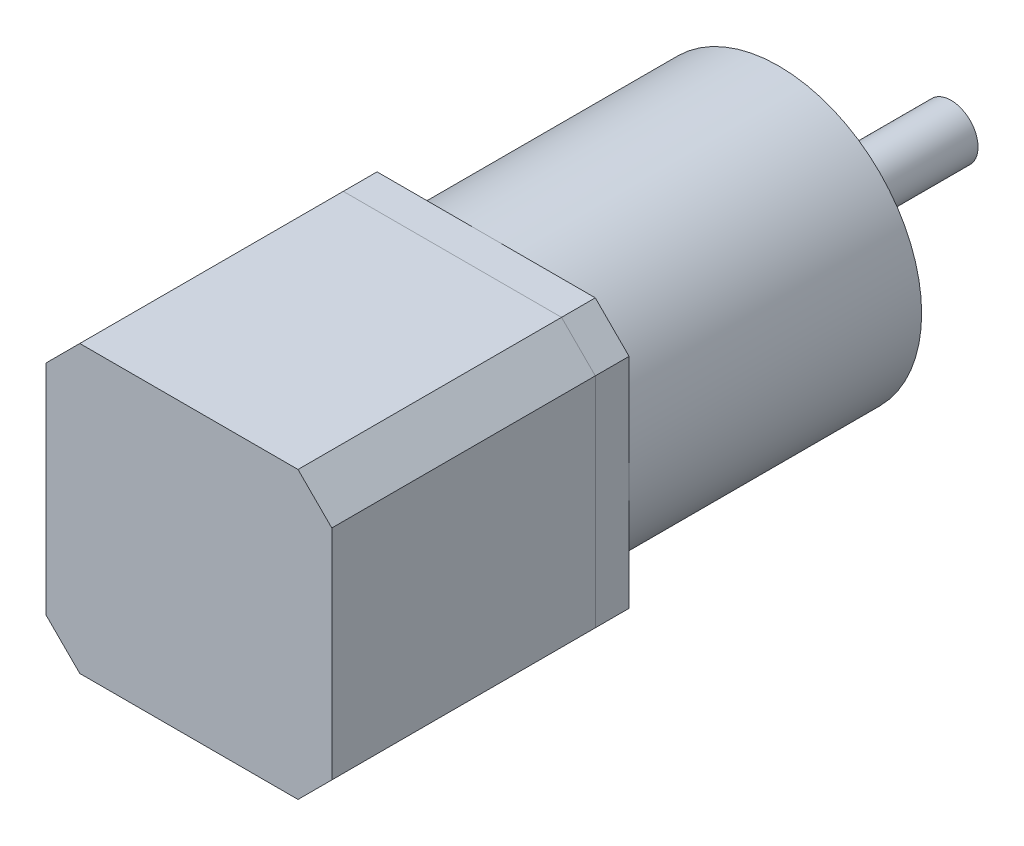
ISO-10303-21;
HEADER;
FILE_DESCRIPTION(('STEP AP214'),'2;1');
FILE_NAME('part.step','',(''),(''),'','','');
FILE_SCHEMA(('AUTOMOTIVE_DESIGN { 1 0 10303 214 1 1 1 1 }'));
ENDSEC;
DATA;
#1=APPLICATION_CONTEXT('core data for automotive mechanical design processes');
#2=APPLICATION_PROTOCOL_DEFINITION('international standard','automotive_design',2000,#1);
#3=PRODUCT_CONTEXT('',#1,'mechanical');
#4=PRODUCT('Part','Part','',(#3));
#5=PRODUCT_RELATED_PRODUCT_CATEGORY('part','',(#4));
#6=PRODUCT_DEFINITION_FORMATION('','',#4);
#7=PRODUCT_DEFINITION_CONTEXT('part definition',#1,'design');
#8=PRODUCT_DEFINITION('design','',#6,#7);
#9=PRODUCT_DEFINITION_SHAPE('','',#8);
#10=(LENGTH_UNIT() NAMED_UNIT(*) SI_UNIT(.MILLI.,.METRE.));
#11=(NAMED_UNIT(*) PLANE_ANGLE_UNIT() SI_UNIT($,.RADIAN.));
#12=(NAMED_UNIT(*) SI_UNIT($,.STERADIAN.) SOLID_ANGLE_UNIT());
#13=UNCERTAINTY_MEASURE_WITH_UNIT(LENGTH_MEASURE(1.E-05),#10,'distance_accuracy_value','');
#14=(GEOMETRIC_REPRESENTATION_CONTEXT(3) GLOBAL_UNCERTAINTY_ASSIGNED_CONTEXT((#13)) GLOBAL_UNIT_ASSIGNED_CONTEXT((#10,
#11,#12)) REPRESENTATION_CONTEXT('',''));
#15=CARTESIAN_POINT('',(0.,0.,0.));
#16=DIRECTION('',(0.,0.,1.));
#17=DIRECTION('',(1.,0.,0.));
#18=AXIS2_PLACEMENT_3D('',#15,#16,#17);
#19=CARTESIAN_POINT('',(0.,0.,-50.8));
#20=DIRECTION('',(0.,0.,1.));
#21=DIRECTION('',(1.,0.,0.));
#22=AXIS2_PLACEMENT_3D('',#19,#20,#21);
#23=CYLINDRICAL_SURFACE('',#22,6.21097509165244);
#24=CARTESIAN_POINT('',(0.,0.,-50.8));
#25=DIRECTION('',(0.,0.,-1.));
#26=DIRECTION('',(-1.,0.,0.));
#27=AXIS2_PLACEMENT_3D('',#24,#25,#26);
#28=CIRCLE('',#27,6.21097509165244);
#29=CARTESIAN_POINT('',(-6.21097509165244,0.,-50.8));
#30=VERTEX_POINT('',#29);
#31=EDGE_CURVE('E11',#30,#30,#28,.T.);
#32=ORIENTED_EDGE('',*,*,#31,.F.);
#33=EDGE_LOOP('',(#32));
#34=FACE_BOUND('',#33,.T.);
#35=CARTESIAN_POINT('',(0.,0.,-50.3));
#36=DIRECTION('',(0.,0.,-1.));
#37=DIRECTION('',(-1.,0.,0.));
#38=AXIS2_PLACEMENT_3D('',#35,#36,#37);
#39=CIRCLE('',#38,6.21097509165244);
#40=CARTESIAN_POINT('',(-6.21097509165244,0.,-50.3));
#41=VERTEX_POINT('',#40);
#42=EDGE_CURVE('E50',#41,#41,#39,.T.);
#43=ORIENTED_EDGE('',*,*,#42,.T.);
#44=EDGE_LOOP('',(#43));
#45=FACE_BOUND('',#44,.T.);
#46=ADVANCED_FACE('F47',(#34,#45),#23,.T.);
#47=CARTESIAN_POINT('',(0.,0.,-50.8));
#48=DIRECTION('',(0.,0.,-1.));
#49=DIRECTION('',(-1.,0.,0.));
#50=AXIS2_PLACEMENT_3D('',#47,#48,#49);
#51=PLANE('',#50);
#52=ORIENTED_EDGE('',*,*,#31,.T.);
#53=EDGE_LOOP('',(#52));
#54=FACE_BOUND('',#53,.T.);
#55=ADVANCED_FACE('F62',(#54),#51,.T.);
#56=CARTESIAN_POINT('',(0.,0.,-50.3));
#57=DIRECTION('',(0.,0.,-1.));
#58=DIRECTION('',(-1.,0.,0.));
#59=AXIS2_PLACEMENT_3D('',#56,#57,#58);
#60=PLANE('',#59);
#61=ORIENTED_EDGE('',*,*,#42,.F.);
#62=EDGE_LOOP('',(#61));
#63=FACE_BOUND('',#62,.T.);
#64=ADVANCED_FACE('F60',(#63),#60,.F.);
#65=CLOSED_SHELL('',(#46,#55,#64));
#66=MANIFOLD_SOLID_BREP('B2',#65);
#67=CARTESIAN_POINT('',(0.,0.,-73.8));
#68=DIRECTION('',(0.,0.,1.));
#69=DIRECTION('',(1.,0.,0.));
#70=AXIS2_PLACEMENT_3D('',#67,#68,#69);
#71=CYLINDRICAL_SURFACE('',#70,4.);
#72=CARTESIAN_POINT('',(0.,0.,-73.8));
#73=DIRECTION('',(0.,0.,-1.));
#74=DIRECTION('',(-1.,0.,0.));
#75=AXIS2_PLACEMENT_3D('',#72,#73,#74);
#76=CIRCLE('',#75,4.);
#77=CARTESIAN_POINT('',(-4.,0.,-73.8));
#78=VERTEX_POINT('',#77);
#79=EDGE_CURVE('E46',#78,#78,#76,.T.);
#80=ORIENTED_EDGE('',*,*,#79,.F.);
#81=EDGE_LOOP('',(#80));
#82=FACE_BOUND('',#81,.T.);
#83=CARTESIAN_POINT('',(0.,0.,-50.3));
#84=DIRECTION('',(0.,0.,-1.));
#85=DIRECTION('',(-1.,0.,0.));
#86=AXIS2_PLACEMENT_3D('',#83,#84,#85);
#87=CIRCLE('',#86,4.);
#88=CARTESIAN_POINT('',(-4.,0.,-50.3));
#89=VERTEX_POINT('',#88);
#90=EDGE_CURVE('E98',#89,#89,#87,.T.);
#91=ORIENTED_EDGE('',*,*,#90,.T.);
#92=EDGE_LOOP('',(#91));
#93=FACE_BOUND('',#92,.T.);
#94=ADVANCED_FACE('F95',(#82,#93),#71,.T.);
#95=CARTESIAN_POINT('',(0.,0.,-73.8));
#96=DIRECTION('',(0.,0.,-1.));
#97=DIRECTION('',(-1.,0.,0.));
#98=AXIS2_PLACEMENT_3D('',#95,#96,#97);
#99=PLANE('',#98);
#100=ORIENTED_EDGE('',*,*,#79,.T.);
#101=EDGE_LOOP('',(#100));
#102=FACE_BOUND('',#101,.T.);
#103=ADVANCED_FACE('F110',(#102),#99,.T.);
#104=CARTESIAN_POINT('',(0.,0.,-50.3));
#105=DIRECTION('',(0.,0.,-1.));
#106=DIRECTION('',(-1.,0.,0.));
#107=AXIS2_PLACEMENT_3D('',#104,#105,#106);
#108=PLANE('',#107);
#109=ORIENTED_EDGE('',*,*,#90,.F.);
#110=EDGE_LOOP('',(#109));
#111=FACE_BOUND('',#110,.T.);
#112=ADVANCED_FACE('F108',(#111),#108,.F.);
#113=CLOSED_SHELL('',(#94,#103,#112));
#114=MANIFOLD_SOLID_BREP('B6',#113);
#115=CARTESIAN_POINT('',(0.,0.,-50.3));
#116=DIRECTION('',(0.,0.,1.));
#117=DIRECTION('',(1.,0.,0.));
#118=AXIS2_PLACEMENT_3D('',#115,#116,#117);
#119=CYLINDRICAL_SURFACE('',#118,11.);
#120=CARTESIAN_POINT('',(0.,0.,-50.3));
#121=DIRECTION('',(0.,0.,-1.));
#122=DIRECTION('',(-1.,0.,0.));
#123=AXIS2_PLACEMENT_3D('',#120,#121,#122);
#124=CIRCLE('',#123,11.);
#125=CARTESIAN_POINT('',(-11.,0.,-50.3));
#126=VERTEX_POINT('',#125);
#127=EDGE_CURVE('E94',#126,#126,#124,.T.);
#128=ORIENTED_EDGE('',*,*,#127,.F.);
#129=EDGE_LOOP('',(#128));
#130=FACE_BOUND('',#129,.T.);
#131=CARTESIAN_POINT('',(0.,0.,-48.3));
#132=DIRECTION('',(0.,0.,-1.));
#133=DIRECTION('',(-1.,0.,0.));
#134=AXIS2_PLACEMENT_3D('',#131,#132,#133);
#135=CIRCLE('',#134,11.);
#136=CARTESIAN_POINT('',(-11.,0.,-48.3));
#137=VERTEX_POINT('',#136);
#138=EDGE_CURVE('E148',#137,#137,#135,.T.);
#139=ORIENTED_EDGE('',*,*,#138,.T.);
#140=EDGE_LOOP('',(#139));
#141=FACE_BOUND('',#140,.T.);
#142=ADVANCED_FACE('F145',(#130,#141),#119,.T.);
#143=CARTESIAN_POINT('',(0.,0.,-50.3));
#144=DIRECTION('',(0.,0.,-1.));
#145=DIRECTION('',(-1.,0.,0.));
#146=AXIS2_PLACEMENT_3D('',#143,#144,#145);
#147=PLANE('',#146);
#148=ORIENTED_EDGE('',*,*,#127,.T.);
#149=EDGE_LOOP('',(#148));
#150=FACE_BOUND('',#149,.T.);
#151=ADVANCED_FACE('F160',(#150),#147,.T.);
#152=CARTESIAN_POINT('',(0.,0.,-48.3));
#153=DIRECTION('',(0.,0.,-1.));
#154=DIRECTION('',(-1.,0.,0.));
#155=AXIS2_PLACEMENT_3D('',#152,#153,#154);
#156=PLANE('',#155);
#157=ORIENTED_EDGE('',*,*,#138,.F.);
#158=EDGE_LOOP('',(#157));
#159=FACE_BOUND('',#158,.T.);
#160=ADVANCED_FACE('F158',(#159),#156,.F.);
#161=CLOSED_SHELL('',(#142,#151,#160));
#162=MANIFOLD_SOLID_BREP('B41',#161);
#163=CARTESIAN_POINT('',(0.,0.,-48.3));
#164=DIRECTION('',(0.,0.,1.));
#165=DIRECTION('',(1.,0.,0.));
#166=AXIS2_PLACEMENT_3D('',#163,#164,#165);
#167=CYLINDRICAL_SURFACE('',#166,21.15);
#168=CARTESIAN_POINT('',(0.,0.,-48.3));
#169=DIRECTION('',(0.,0.,-1.));
#170=DIRECTION('',(-1.,0.,0.));
#171=AXIS2_PLACEMENT_3D('',#168,#169,#170);
#172=CIRCLE('',#171,21.15);
#173=CARTESIAN_POINT('',(-21.15,0.,-48.3));
#174=VERTEX_POINT('',#173);
#175=EDGE_CURVE('E144',#174,#174,#172,.T.);
#176=ORIENTED_EDGE('',*,*,#175,.F.);
#177=EDGE_LOOP('',(#176));
#178=FACE_BOUND('',#177,.T.);
#179=CARTESIAN_POINT('',(0.,0.,-5.));
#180=DIRECTION('',(0.,0.,-1.));
#181=DIRECTION('',(-1.,0.,0.));
#182=AXIS2_PLACEMENT_3D('',#179,#180,#181);
#183=CIRCLE('',#182,21.15);
#184=CARTESIAN_POINT('',(-21.15,0.,-5.));
#185=VERTEX_POINT('',#184);
#186=EDGE_CURVE('E204',#185,#185,#183,.T.);
#187=ORIENTED_EDGE('',*,*,#186,.T.);
#188=EDGE_LOOP('',(#187));
#189=FACE_BOUND('',#188,.T.);
#190=ADVANCED_FACE('F201',(#178,#189),#167,.T.);
#191=CARTESIAN_POINT('',(0.,0.,-48.3));
#192=DIRECTION('',(0.,0.,-1.));
#193=DIRECTION('',(-1.,0.,0.));
#194=AXIS2_PLACEMENT_3D('',#191,#192,#193);
#195=PLANE('',#194);
#196=CARTESIAN_POINT('',(-17.5000000000005,4.95236783133562E-13,-48.3));
#197=DIRECTION('',(0.,0.,-1.));
#198=DIRECTION('',(-1.,0.,0.));
#199=AXIS2_PLACEMENT_3D('',#196,#197,#198);
#200=CIRCLE('',#199,1.14415066271215);
#201=CARTESIAN_POINT('',(-18.6441506627126,4.95236783133562E-13,-48.3));
#202=VERTEX_POINT('',#201);
#203=EDGE_CURVE('E231',#202,#202,#200,.T.);
#204=ORIENTED_EDGE('',*,*,#203,.F.);
#205=EDGE_LOOP('',(#204));
#206=FACE_BOUND('',#205,.T.);
#207=CARTESIAN_POINT('',(-9.90473566267125E-13,-17.5,-48.3));
#208=DIRECTION('',(0.,0.,-1.));
#209=DIRECTION('',(-1.,0.,0.));
#210=AXIS2_PLACEMENT_3D('',#207,#208,#209);
#211=CIRCLE('',#210,1.14415066271282);
#212=CARTESIAN_POINT('',(-1.14415066271381,-17.5,-48.3));
#213=VERTEX_POINT('',#212);
#214=EDGE_CURVE('E225',#213,#213,#211,.T.);
#215=ORIENTED_EDGE('',*,*,#214,.F.);
#216=EDGE_LOOP('',(#215));
#217=FACE_BOUND('',#216,.T.);
#218=CARTESIAN_POINT('',(17.4999999999995,-4.9737991503207E-13,-48.3));
#219=DIRECTION('',(0.,0.,-1.));
#220=DIRECTION('',(-1.,0.,0.));
#221=AXIS2_PLACEMENT_3D('',#218,#219,#220);
#222=CIRCLE('',#221,1.14415066271255);
#223=CARTESIAN_POINT('',(16.355849337287,-4.9737991503207E-13,-48.3));
#224=VERTEX_POINT('',#223);
#225=EDGE_CURVE('E219',#224,#224,#222,.T.);
#226=ORIENTED_EDGE('',*,*,#225,.F.);
#227=EDGE_LOOP('',(#226));
#228=FACE_BOUND('',#227,.T.);
#229=CARTESIAN_POINT('',(0.,17.5,-48.3));
#230=DIRECTION('',(0.,0.,-1.));
#231=DIRECTION('',(-1.,0.,0.));
#232=AXIS2_PLACEMENT_3D('',#229,#230,#231);
#233=CIRCLE('',#232,1.14415066271176);
#234=CARTESIAN_POINT('',(-1.14415066271176,17.5,-48.3));
#235=VERTEX_POINT('',#234);
#236=EDGE_CURVE('E213',#235,#235,#233,.T.);
#237=ORIENTED_EDGE('',*,*,#236,.F.);
#238=EDGE_LOOP('',(#237));
#239=FACE_BOUND('',#238,.T.);
#240=ORIENTED_EDGE('',*,*,#175,.T.);
#241=EDGE_LOOP('',(#240));
#242=FACE_BOUND('',#241,.T.);
#243=ADVANCED_FACE('F246',(#206,#217,#228,#239,#242),#195,.T.);
#244=CARTESIAN_POINT('',(0.,0.,-5.));
#245=DIRECTION('',(0.,0.,-1.));
#246=DIRECTION('',(-1.,0.,0.));
#247=AXIS2_PLACEMENT_3D('',#244,#245,#246);
#248=PLANE('',#247);
#249=ORIENTED_EDGE('',*,*,#186,.F.);
#250=EDGE_LOOP('',(#249));
#251=FACE_BOUND('',#250,.T.);
#252=ADVANCED_FACE('F249',(#251),#248,.F.);
#253=CARTESIAN_POINT('',(0.,17.5,-38.3));
#254=DIRECTION('',(0.,0.,-1.));
#255=DIRECTION('',(-1.,0.,0.));
#256=AXIS2_PLACEMENT_3D('',#253,#254,#255);
#257=CYLINDRICAL_SURFACE('',#256,1.14415066271176);
#258=CARTESIAN_POINT('',(0.,17.5,-38.3));
#259=DIRECTION('',(0.,0.,-1.));
#260=DIRECTION('',(-1.,0.,0.));
#261=AXIS2_PLACEMENT_3D('',#258,#259,#260);
#262=CIRCLE('',#261,1.14415066271176);
#263=CARTESIAN_POINT('',(-1.14415066271176,17.5,-38.3));
#264=VERTEX_POINT('',#263);
#265=EDGE_CURVE('E211',#264,#264,#262,.T.);
#266=ORIENTED_EDGE('',*,*,#265,.F.);
#267=EDGE_LOOP('',(#266));
#268=FACE_BOUND('',#267,.T.);
#269=ORIENTED_EDGE('',*,*,#236,.T.);
#270=EDGE_LOOP('',(#269));
#271=FACE_BOUND('',#270,.T.);
#272=ADVANCED_FACE('F257',(#268,#271),#257,.F.);
#273=CARTESIAN_POINT('',(0.,17.5,-38.3));
#274=DIRECTION('',(0.,0.,-1.));
#275=DIRECTION('',(-1.,0.,0.));
#276=AXIS2_PLACEMENT_3D('',#273,#274,#275);
#277=PLANE('',#276);
#278=ORIENTED_EDGE('',*,*,#265,.T.);
#279=EDGE_LOOP('',(#278));
#280=FACE_BOUND('',#279,.T.);
#281=ADVANCED_FACE('F259',(#280),#277,.T.);
#282=CARTESIAN_POINT('',(17.4999999999995,-4.9737991503207E-13,-38.3));
#283=DIRECTION('',(0.,0.,-1.));
#284=DIRECTION('',(-1.,0.,0.));
#285=AXIS2_PLACEMENT_3D('',#282,#283,#284);
#286=CYLINDRICAL_SURFACE('',#285,1.14415066271255);
#287=CARTESIAN_POINT('',(17.4999999999995,-4.9737991503207E-13,-38.3));
#288=DIRECTION('',(0.,0.,-1.));
#289=DIRECTION('',(-1.,0.,0.));
#290=AXIS2_PLACEMENT_3D('',#287,#288,#289);
#291=CIRCLE('',#290,1.14415066271255);
#292=CARTESIAN_POINT('',(16.355849337287,-4.9737991503207E-13,-38.3));
#293=VERTEX_POINT('',#292);
#294=EDGE_CURVE('E222',#293,#293,#291,.T.);
#295=ORIENTED_EDGE('',*,*,#294,.F.);
#296=EDGE_LOOP('',(#295));
#297=FACE_BOUND('',#296,.T.);
#298=ORIENTED_EDGE('',*,*,#225,.T.);
#299=EDGE_LOOP('',(#298));
#300=FACE_BOUND('',#299,.T.);
#301=ADVANCED_FACE('F266',(#297,#300),#286,.F.);
#302=CARTESIAN_POINT('',(17.4999999999995,-4.9737991503207E-13,-38.3));
#303=DIRECTION('',(0.,0.,-1.));
#304=DIRECTION('',(-1.,0.,0.));
#305=AXIS2_PLACEMENT_3D('',#302,#303,#304);
#306=PLANE('',#305);
#307=ORIENTED_EDGE('',*,*,#294,.T.);
#308=EDGE_LOOP('',(#307));
#309=FACE_BOUND('',#308,.T.);
#310=ADVANCED_FACE('F306',(#309),#306,.T.);
#311=CARTESIAN_POINT('',(-9.90473566267125E-13,-17.5,-38.3));
#312=DIRECTION('',(0.,0.,-1.));
#313=DIRECTION('',(-1.,0.,0.));
#314=AXIS2_PLACEMENT_3D('',#311,#312,#313);
#315=CYLINDRICAL_SURFACE('',#314,1.14415066271282);
#316=CARTESIAN_POINT('',(-9.90473566267125E-13,-17.5,-38.3));
#317=DIRECTION('',(0.,0.,-1.));
#318=DIRECTION('',(-1.,0.,0.));
#319=AXIS2_PLACEMENT_3D('',#316,#317,#318);
#320=CIRCLE('',#319,1.14415066271282);
#321=CARTESIAN_POINT('',(-1.14415066271381,-17.5,-38.3));
#322=VERTEX_POINT('',#321);
#323=EDGE_CURVE('E228',#322,#322,#320,.T.);
#324=ORIENTED_EDGE('',*,*,#323,.F.);
#325=EDGE_LOOP('',(#324));
#326=FACE_BOUND('',#325,.T.);
#327=ORIENTED_EDGE('',*,*,#214,.T.);
#328=EDGE_LOOP('',(#327));
#329=FACE_BOUND('',#328,.T.);
#330=ADVANCED_FACE('F315',(#326,#329),#315,.F.);
#331=CARTESIAN_POINT('',(-9.90473566267125E-13,-17.5,-38.3));
#332=DIRECTION('',(0.,0.,-1.));
#333=DIRECTION('',(-1.,0.,0.));
#334=AXIS2_PLACEMENT_3D('',#331,#332,#333);
#335=PLANE('',#334);
#336=ORIENTED_EDGE('',*,*,#323,.T.);
#337=EDGE_LOOP('',(#336));
#338=FACE_BOUND('',#337,.T.);
#339=ADVANCED_FACE('F242',(#338),#335,.T.);
#340=CARTESIAN_POINT('',(-17.5000000000005,4.95236783133562E-13,-38.3));
#341=DIRECTION('',(0.,0.,-1.));
#342=DIRECTION('',(-1.,0.,0.));
#343=AXIS2_PLACEMENT_3D('',#340,#341,#342);
#344=CYLINDRICAL_SURFACE('',#343,1.14415066271215);
#345=CARTESIAN_POINT('',(-17.5000000000005,4.95236783133562E-13,-38.3));
#346=DIRECTION('',(0.,0.,-1.));
#347=DIRECTION('',(-1.,0.,0.));
#348=AXIS2_PLACEMENT_3D('',#345,#346,#347);
#349=CIRCLE('',#348,1.14415066271215);
#350=CARTESIAN_POINT('',(-18.6441506627126,4.95236783133562E-13,-38.3));
#351=VERTEX_POINT('',#350);
#352=EDGE_CURVE('E216',#351,#351,#349,.T.);
#353=ORIENTED_EDGE('',*,*,#352,.F.);
#354=EDGE_LOOP('',(#353));
#355=FACE_BOUND('',#354,.T.);
#356=ORIENTED_EDGE('',*,*,#203,.T.);
#357=EDGE_LOOP('',(#356));
#358=FACE_BOUND('',#357,.T.);
#359=ADVANCED_FACE('F239',(#355,#358),#344,.F.);
#360=CARTESIAN_POINT('',(-17.5000000000005,4.95236783133562E-13,-38.3));
#361=DIRECTION('',(0.,0.,-1.));
#362=DIRECTION('',(-1.,0.,0.));
#363=AXIS2_PLACEMENT_3D('',#360,#361,#362);
#364=PLANE('',#363);
#365=ORIENTED_EDGE('',*,*,#352,.T.);
#366=EDGE_LOOP('',(#365));
#367=FACE_BOUND('',#366,.T.);
#368=ADVANCED_FACE('F237',(#367),#364,.T.);
#369=CLOSED_SHELL('',(#190,#243,#252,#272,#281,#301,#310,#330,#339,#359,#368));
#370=MANIFOLD_SOLID_BREP('B89',#369);
#371=CARTESIAN_POINT('',(-21.15,-21.15,-5.));
#372=DIRECTION('',(1.,0.,0.));
#373=DIRECTION('',(0.,0.,-1.));
#374=AXIS2_PLACEMENT_3D('',#371,#372,#373);
#375=PLANE('',#374);
#376=DIRECTION('',(0.,1.,0.));
#377=VECTOR('',#376,1.);
#378=CARTESIAN_POINT('',(-21.15,-21.15,-5.));
#379=LINE('',#378,#377);
#380=CARTESIAN_POINT('',(-21.15,-16.15,-5.));
#381=VERTEX_POINT('',#380);
#382=CARTESIAN_POINT('',(-21.15,16.15,-5.));
#383=VERTEX_POINT('',#382);
#384=EDGE_CURVE('E461',#381,#383,#379,.T.);
#385=ORIENTED_EDGE('',*,*,#384,.F.);
#386=DIRECTION('',(0.,0.,1.));
#387=VECTOR('',#386,1.);
#388=CARTESIAN_POINT('',(-21.15,-16.15,-5.));
#389=LINE('',#388,#387);
#390=CARTESIAN_POINT('',(-21.15,-16.15,0.));
#391=VERTEX_POINT('',#390);
#392=EDGE_CURVE('E487',#381,#391,#389,.T.);
#393=ORIENTED_EDGE('',*,*,#392,.T.);
#394=DIRECTION('',(0.,1.,0.));
#395=VECTOR('',#394,1.);
#396=CARTESIAN_POINT('',(-21.15,-21.15,0.));
#397=LINE('',#396,#395);
#398=CARTESIAN_POINT('',(-21.15,16.15,0.));
#399=VERTEX_POINT('',#398);
#400=EDGE_CURVE('E495',#391,#399,#397,.T.);
#401=ORIENTED_EDGE('',*,*,#400,.T.);
#402=DIRECTION('',(0.,0.,-1.));
#403=VECTOR('',#402,1.);
#404=CARTESIAN_POINT('',(-21.15,16.15,-5.));
#405=LINE('',#404,#403);
#406=EDGE_CURVE('E485',#399,#383,#405,.T.);
#407=ORIENTED_EDGE('',*,*,#406,.T.);
#408=EDGE_LOOP('',(#385,#393,#401,#407));
#409=FACE_BOUND('',#408,.T.);
#410=ADVANCED_FACE('F370',(#409),#375,.F.);
#411=CARTESIAN_POINT('',(21.15,21.15,-5.));
#412=DIRECTION('',(0.,-1.,0.));
#413=DIRECTION('',(0.,0.,-1.));
#414=AXIS2_PLACEMENT_3D('',#411,#412,#413);
#415=PLANE('',#414);
#416=DIRECTION('',(1.,0.,0.));
#417=VECTOR('',#416,1.);
#418=CARTESIAN_POINT('',(21.15,21.15,0.));
#419=LINE('',#418,#417);
#420=CARTESIAN_POINT('',(-16.15,21.15,0.));
#421=VERTEX_POINT('',#420);
#422=CARTESIAN_POINT('',(16.15,21.15,0.));
#423=VERTEX_POINT('',#422);
#424=EDGE_CURVE('E466',#421,#423,#419,.T.);
#425=ORIENTED_EDGE('',*,*,#424,.T.);
#426=DIRECTION('',(0.,0.,-1.));
#427=VECTOR('',#426,1.);
#428=CARTESIAN_POINT('',(16.15,21.15,-5.));
#429=LINE('',#428,#427);
#430=CARTESIAN_POINT('',(16.15,21.15,-5.));
#431=VERTEX_POINT('',#430);
#432=EDGE_CURVE('E199',#423,#431,#429,.T.);
#433=ORIENTED_EDGE('',*,*,#432,.T.);
#434=DIRECTION('',(1.,0.,0.));
#435=VECTOR('',#434,1.);
#436=CARTESIAN_POINT('',(21.15,21.15,-5.));
#437=LINE('',#436,#435);
#438=CARTESIAN_POINT('',(-16.15,21.15,-5.));
#439=VERTEX_POINT('',#438);
#440=EDGE_CURVE('E464',#439,#431,#437,.T.);
#441=ORIENTED_EDGE('',*,*,#440,.F.);
#442=DIRECTION('',(0.,0.,1.));
#443=VECTOR('',#442,1.);
#444=CARTESIAN_POINT('',(-16.15,21.15,-5.));
#445=LINE('',#444,#443);
#446=EDGE_CURVE('E378',#439,#421,#445,.T.);
#447=ORIENTED_EDGE('',*,*,#446,.T.);
#448=EDGE_LOOP('',(#425,#433,#441,#447));
#449=FACE_BOUND('',#448,.T.);
#450=ADVANCED_FACE('F492',(#449),#415,.F.);
#451=CARTESIAN_POINT('',(21.15,-21.15,-5.));
#452=DIRECTION('',(-1.,0.,0.));
#453=DIRECTION('',(0.,0.,1.));
#454=AXIS2_PLACEMENT_3D('',#451,#452,#453);
#455=PLANE('',#454);
#456=DIRECTION('',(0.,-1.,0.));
#457=VECTOR('',#456,1.);
#458=CARTESIAN_POINT('',(21.15,-21.15,0.));
#459=LINE('',#458,#457);
#460=CARTESIAN_POINT('',(21.15,16.15,0.));
#461=VERTEX_POINT('',#460);
#462=CARTESIAN_POINT('',(21.15,-16.15,0.));
#463=VERTEX_POINT('',#462);
#464=EDGE_CURVE('E462',#461,#463,#459,.T.);
#465=ORIENTED_EDGE('',*,*,#464,.T.);
#466=DIRECTION('',(0.,0.,-1.));
#467=VECTOR('',#466,1.);
#468=CARTESIAN_POINT('',(21.15,-16.15,-5.));
#469=LINE('',#468,#467);
#470=CARTESIAN_POINT('',(21.15,-16.15,-5.));
#471=VERTEX_POINT('',#470);
#472=EDGE_CURVE('E440',#463,#471,#469,.T.);
#473=ORIENTED_EDGE('',*,*,#472,.T.);
#474=DIRECTION('',(0.,-1.,0.));
#475=VECTOR('',#474,1.);
#476=CARTESIAN_POINT('',(21.15,-21.15,-5.));
#477=LINE('',#476,#475);
#478=CARTESIAN_POINT('',(21.15,16.15,-5.));
#479=VERTEX_POINT('',#478);
#480=EDGE_CURVE('E499',#479,#471,#477,.T.);
#481=ORIENTED_EDGE('',*,*,#480,.F.);
#482=DIRECTION('',(0.,0.,1.));
#483=VECTOR('',#482,1.);
#484=CARTESIAN_POINT('',(21.15,16.15,-5.));
#485=LINE('',#484,#483);
#486=EDGE_CURVE('E445',#479,#461,#485,.T.);
#487=ORIENTED_EDGE('',*,*,#486,.T.);
#488=EDGE_LOOP('',(#465,#473,#481,#487));
#489=FACE_BOUND('',#488,.T.);
#490=ADVANCED_FACE('F509',(#489),#455,.F.);
#491=CARTESIAN_POINT('',(21.15,-21.15,-5.));
#492=DIRECTION('',(0.,1.,0.));
#493=DIRECTION('',(0.,0.,1.));
#494=AXIS2_PLACEMENT_3D('',#491,#492,#493);
#495=PLANE('',#494);
#496=DIRECTION('',(-1.,0.,0.));
#497=VECTOR('',#496,1.);
#498=CARTESIAN_POINT('',(21.15,-21.15,-5.));
#499=LINE('',#498,#497);
#500=CARTESIAN_POINT('',(16.15,-21.15,-5.));
#501=VERTEX_POINT('',#500);
#502=CARTESIAN_POINT('',(-16.15,-21.15,-5.));
#503=VERTEX_POINT('',#502);
#504=EDGE_CURVE('E455',#501,#503,#499,.T.);
#505=ORIENTED_EDGE('',*,*,#504,.F.);
#506=DIRECTION('',(0.,0.,1.));
#507=VECTOR('',#506,1.);
#508=CARTESIAN_POINT('',(16.15,-21.15,-5.));
#509=LINE('',#508,#507);
#510=CARTESIAN_POINT('',(16.15,-21.15,0.));
#511=VERTEX_POINT('',#510);
#512=EDGE_CURVE('E439',#501,#511,#509,.T.);
#513=ORIENTED_EDGE('',*,*,#512,.T.);
#514=DIRECTION('',(-1.,0.,0.));
#515=VECTOR('',#514,1.);
#516=CARTESIAN_POINT('',(21.15,-21.15,0.));
#517=LINE('',#516,#515);
#518=CARTESIAN_POINT('',(-16.15,-21.15,0.));
#519=VERTEX_POINT('',#518);
#520=EDGE_CURVE('E452',#511,#519,#517,.T.);
#521=ORIENTED_EDGE('',*,*,#520,.T.);
#522=DIRECTION('',(0.,0.,-1.));
#523=VECTOR('',#522,1.);
#524=CARTESIAN_POINT('',(-16.15,-21.15,-5.));
#525=LINE('',#524,#523);
#526=EDGE_CURVE('E457',#519,#503,#525,.T.);
#527=ORIENTED_EDGE('',*,*,#526,.T.);
#528=EDGE_LOOP('',(#505,#513,#521,#527));
#529=FACE_BOUND('',#528,.T.);
#530=ADVANCED_FACE('F451',(#529),#495,.F.);
#531=CARTESIAN_POINT('',(0.,0.,-5.));
#532=DIRECTION('',(0.,0.,1.));
#533=DIRECTION('',(1.,0.,0.));
#534=AXIS2_PLACEMENT_3D('',#531,#532,#533);
#535=PLANE('',#534);
#536=ORIENTED_EDGE('',*,*,#480,.T.);
#537=DIRECTION('',(0.707106781186546,0.707106781186549,0.));
#538=VECTOR('',#537,1.);
#539=CARTESIAN_POINT('',(16.15,-21.15,-5.));
#540=LINE('',#539,#538);
#541=EDGE_CURVE('E483',#471,#501,#540,.F.);
#542=ORIENTED_EDGE('',*,*,#541,.T.);
#543=ORIENTED_EDGE('',*,*,#504,.T.);
#544=DIRECTION('',(0.707106781186549,-0.707106781186546,0.));
#545=VECTOR('',#544,1.);
#546=CARTESIAN_POINT('',(-21.15,-16.15,-5.));
#547=LINE('',#546,#545);
#548=EDGE_CURVE('E481',#503,#381,#547,.F.);
#549=ORIENTED_EDGE('',*,*,#548,.T.);
#550=ORIENTED_EDGE('',*,*,#384,.T.);
#551=DIRECTION('',(-0.707106781186546,-0.707106781186549,0.));
#552=VECTOR('',#551,1.);
#553=CARTESIAN_POINT('',(-16.15,21.15,-5.));
#554=LINE('',#553,#552);
#555=EDGE_CURVE('E390',#383,#439,#554,.F.);
#556=ORIENTED_EDGE('',*,*,#555,.T.);
#557=ORIENTED_EDGE('',*,*,#440,.T.);
#558=DIRECTION('',(-0.707106781186549,0.707106781186546,0.));
#559=VECTOR('',#558,1.);
#560=CARTESIAN_POINT('',(21.15,16.15,-5.));
#561=LINE('',#560,#559);
#562=EDGE_CURVE('E479',#431,#479,#561,.F.);
#563=ORIENTED_EDGE('',*,*,#562,.T.);
#564=EDGE_LOOP('',(#536,#542,#543,#549,#550,#556,#557,#563));
#565=FACE_BOUND('',#564,.T.);
#566=ADVANCED_FACE('F503',(#565),#535,.F.);
#567=CARTESIAN_POINT('',(0.,0.,0.));
#568=DIRECTION('',(0.,0.,1.));
#569=DIRECTION('',(1.,0.,0.));
#570=AXIS2_PLACEMENT_3D('',#567,#568,#569);
#571=PLANE('',#570);
#572=ORIENTED_EDGE('',*,*,#520,.F.);
#573=DIRECTION('',(-0.707106781186546,-0.707106781186549,0.));
#574=VECTOR('',#573,1.);
#575=CARTESIAN_POINT('',(18.65,-18.6499999999999,0.));
#576=LINE('',#575,#574);
#577=EDGE_CURVE('E435',#511,#463,#576,.F.);
#578=ORIENTED_EDGE('',*,*,#577,.T.);
#579=ORIENTED_EDGE('',*,*,#464,.F.);
#580=DIRECTION('',(0.707106781186549,-0.707106781186546,0.));
#581=VECTOR('',#580,1.);
#582=CARTESIAN_POINT('',(18.6499999999999,18.65,0.));
#583=LINE('',#582,#581);
#584=EDGE_CURVE('E472',#461,#423,#583,.F.);
#585=ORIENTED_EDGE('',*,*,#584,.T.);
#586=ORIENTED_EDGE('',*,*,#424,.F.);
#587=DIRECTION('',(0.707106781186546,0.707106781186549,0.));
#588=VECTOR('',#587,1.);
#589=CARTESIAN_POINT('',(-18.65,18.65,0.));
#590=LINE('',#589,#588);
#591=EDGE_CURVE('E456',#421,#399,#590,.F.);
#592=ORIENTED_EDGE('',*,*,#591,.T.);
#593=ORIENTED_EDGE('',*,*,#400,.F.);
#594=DIRECTION('',(-0.707106781186549,0.707106781186546,0.));
#595=VECTOR('',#594,1.);
#596=CARTESIAN_POINT('',(-18.65,-18.65,0.));
#597=LINE('',#596,#595);
#598=EDGE_CURVE('E446',#391,#519,#597,.F.);
#599=ORIENTED_EDGE('',*,*,#598,.T.);
#600=EDGE_LOOP('',(#572,#578,#579,#585,#586,#592,#593,#599));
#601=FACE_BOUND('',#600,.T.);
#602=ADVANCED_FACE('F459',(#601),#571,.T.);
#603=CARTESIAN_POINT('',(16.15,-21.15,-5.));
#604=DIRECTION('',(-0.707106781186549,0.707106781186546,0.));
#605=DIRECTION('',(0.,0.,1.));
#606=AXIS2_PLACEMENT_3D('',#603,#604,#605);
#607=PLANE('',#606);
#608=ORIENTED_EDGE('',*,*,#541,.F.);
#609=ORIENTED_EDGE('',*,*,#472,.F.);
#610=ORIENTED_EDGE('',*,*,#577,.F.);
#611=ORIENTED_EDGE('',*,*,#512,.F.);
#612=EDGE_LOOP('',(#608,#609,#610,#611));
#613=FACE_BOUND('',#612,.T.);
#614=ADVANCED_FACE('F438',(#613),#607,.F.);
#615=CARTESIAN_POINT('',(-21.15,-16.15,-5.));
#616=DIRECTION('',(0.707106781186546,0.707106781186549,0.));
#617=DIRECTION('',(0.,0.,1.));
#618=AXIS2_PLACEMENT_3D('',#615,#616,#617);
#619=PLANE('',#618);
#620=ORIENTED_EDGE('',*,*,#548,.F.);
#621=ORIENTED_EDGE('',*,*,#526,.F.);
#622=ORIENTED_EDGE('',*,*,#598,.F.);
#623=ORIENTED_EDGE('',*,*,#392,.F.);
#624=EDGE_LOOP('',(#620,#621,#622,#623));
#625=FACE_BOUND('',#624,.T.);
#626=ADVANCED_FACE('F514',(#625),#619,.F.);
#627=CARTESIAN_POINT('',(21.15,16.15,-5.));
#628=DIRECTION('',(-0.707106781186546,-0.707106781186549,0.));
#629=DIRECTION('',(0.,0.,1.));
#630=AXIS2_PLACEMENT_3D('',#627,#628,#629);
#631=PLANE('',#630);
#632=ORIENTED_EDGE('',*,*,#562,.F.);
#633=ORIENTED_EDGE('',*,*,#432,.F.);
#634=ORIENTED_EDGE('',*,*,#584,.F.);
#635=ORIENTED_EDGE('',*,*,#486,.F.);
#636=EDGE_LOOP('',(#632,#633,#634,#635));
#637=FACE_BOUND('',#636,.T.);
#638=ADVANCED_FACE('F507',(#637),#631,.F.);
#639=CARTESIAN_POINT('',(-16.15,21.15,-5.));
#640=DIRECTION('',(0.707106781186549,-0.707106781186546,0.));
#641=DIRECTION('',(0.,0.,1.));
#642=AXIS2_PLACEMENT_3D('',#639,#640,#641);
#643=PLANE('',#642);
#644=ORIENTED_EDGE('',*,*,#555,.F.);
#645=ORIENTED_EDGE('',*,*,#406,.F.);
#646=ORIENTED_EDGE('',*,*,#591,.F.);
#647=ORIENTED_EDGE('',*,*,#446,.F.);
#648=EDGE_LOOP('',(#644,#645,#646,#647));
#649=FACE_BOUND('',#648,.T.);
#650=ADVANCED_FACE('F372',(#649),#643,.F.);
#651=CLOSED_SHELL('',(#410,#450,#490,#530,#566,#602,#614,#626,#638,#650));
#652=MANIFOLD_SOLID_BREP('B139',#651);
#653=CARTESIAN_POINT('',(21.15,21.15,39.));
#654=DIRECTION('',(-1.,0.,0.));
#655=DIRECTION('',(0.,-1.,0.));
#656=AXIS2_PLACEMENT_3D('',#653,#654,#655);
#657=PLANE('',#656);
#658=DIRECTION('',(0.,1.,0.));
#659=VECTOR('',#658,1.);
#660=CARTESIAN_POINT('',(21.15,21.15,39.));
#661=LINE('',#660,#659);
#662=CARTESIAN_POINT('',(21.15,-16.15,39.));
#663=VERTEX_POINT('',#662);
#664=CARTESIAN_POINT('',(21.15,16.15,39.));
#665=VERTEX_POINT('',#664);
#666=EDGE_CURVE('E688',#663,#665,#661,.T.);
#667=ORIENTED_EDGE('',*,*,#666,.F.);
#668=DIRECTION('',(0.,0.,-1.));
#669=VECTOR('',#668,1.);
#670=CARTESIAN_POINT('',(21.15,-16.15,39.));
#671=LINE('',#670,#669);
#672=CARTESIAN_POINT('',(21.15,-16.15,0.));
#673=VERTEX_POINT('',#672);
#674=EDGE_CURVE('E714',#663,#673,#671,.T.);
#675=ORIENTED_EDGE('',*,*,#674,.T.);
#676=DIRECTION('',(0.,1.,0.));
#677=VECTOR('',#676,1.);
#678=CARTESIAN_POINT('',(21.15,21.15,0.));
#679=LINE('',#678,#677);
#680=CARTESIAN_POINT('',(21.15,16.15,0.));
#681=VERTEX_POINT('',#680);
#682=EDGE_CURVE('E722',#673,#681,#679,.T.);
#683=ORIENTED_EDGE('',*,*,#682,.T.);
#684=DIRECTION('',(0.,0.,1.));
#685=VECTOR('',#684,1.);
#686=CARTESIAN_POINT('',(21.15,16.15,39.));
#687=LINE('',#686,#685);
#688=EDGE_CURVE('E712',#681,#665,#687,.T.);
#689=ORIENTED_EDGE('',*,*,#688,.T.);
#690=EDGE_LOOP('',(#667,#675,#683,#689));
#691=FACE_BOUND('',#690,.T.);
#692=ADVANCED_FACE('F597',(#691),#657,.F.);
#693=CARTESIAN_POINT('',(-21.15,21.15,39.));
#694=DIRECTION('',(0.,-1.,0.));
#695=DIRECTION('',(0.,0.,-1.));
#696=AXIS2_PLACEMENT_3D('',#693,#694,#695);
#697=PLANE('',#696);
#698=DIRECTION('',(-1.,0.,0.));
#699=VECTOR('',#698,1.);
#700=CARTESIAN_POINT('',(-21.15,21.15,0.));
#701=LINE('',#700,#699);
#702=CARTESIAN_POINT('',(16.15,21.15,0.));
#703=VERTEX_POINT('',#702);
#704=CARTESIAN_POINT('',(-16.15,21.15,0.));
#705=VERTEX_POINT('',#704);
#706=EDGE_CURVE('E693',#703,#705,#701,.T.);
#707=ORIENTED_EDGE('',*,*,#706,.T.);
#708=DIRECTION('',(0.,0.,1.));
#709=VECTOR('',#708,1.);
#710=CARTESIAN_POINT('',(-16.15,21.15,39.));
#711=LINE('',#710,#709);
#712=CARTESIAN_POINT('',(-16.15,21.15,39.));
#713=VERTEX_POINT('',#712);
#714=EDGE_CURVE('E368',#705,#713,#711,.T.);
#715=ORIENTED_EDGE('',*,*,#714,.T.);
#716=DIRECTION('',(-1.,0.,0.));
#717=VECTOR('',#716,1.);
#718=CARTESIAN_POINT('',(-21.15,21.15,39.));
#719=LINE('',#718,#717);
#720=CARTESIAN_POINT('',(16.15,21.15,39.));
#721=VERTEX_POINT('',#720);
#722=EDGE_CURVE('E691',#721,#713,#719,.T.);
#723=ORIENTED_EDGE('',*,*,#722,.F.);
#724=DIRECTION('',(0.,0.,-1.));
#725=VECTOR('',#724,1.);
#726=CARTESIAN_POINT('',(16.15,21.15,39.));
#727=LINE('',#726,#725);
#728=EDGE_CURVE('E605',#721,#703,#727,.T.);
#729=ORIENTED_EDGE('',*,*,#728,.T.);
#730=EDGE_LOOP('',(#707,#715,#723,#729));
#731=FACE_BOUND('',#730,.T.);
#732=ADVANCED_FACE('F719',(#731),#697,.F.);
#733=CARTESIAN_POINT('',(-21.15,21.15,39.));
#734=DIRECTION('',(1.,0.,0.));
#735=DIRECTION('',(0.,1.,0.));
#736=AXIS2_PLACEMENT_3D('',#733,#734,#735);
#737=PLANE('',#736);
#738=DIRECTION('',(0.,-1.,0.));
#739=VECTOR('',#738,1.);
#740=CARTESIAN_POINT('',(-21.15,21.15,0.));
#741=LINE('',#740,#739);
#742=CARTESIAN_POINT('',(-21.15,16.15,0.));
#743=VERTEX_POINT('',#742);
#744=CARTESIAN_POINT('',(-21.15,-16.15,0.));
#745=VERTEX_POINT('',#744);
#746=EDGE_CURVE('E689',#743,#745,#741,.T.);
#747=ORIENTED_EDGE('',*,*,#746,.T.);
#748=DIRECTION('',(0.,0.,1.));
#749=VECTOR('',#748,1.);
#750=CARTESIAN_POINT('',(-21.15,-16.15,39.));
#751=LINE('',#750,#749);
#752=CARTESIAN_POINT('',(-21.15,-16.15,39.));
#753=VERTEX_POINT('',#752);
#754=EDGE_CURVE('E667',#745,#753,#751,.T.);
#755=ORIENTED_EDGE('',*,*,#754,.T.);
#756=DIRECTION('',(0.,-1.,0.));
#757=VECTOR('',#756,1.);
#758=CARTESIAN_POINT('',(-21.15,21.15,39.));
#759=LINE('',#758,#757);
#760=CARTESIAN_POINT('',(-21.15,16.15,39.));
#761=VERTEX_POINT('',#760);
#762=EDGE_CURVE('E726',#761,#753,#759,.T.);
#763=ORIENTED_EDGE('',*,*,#762,.F.);
#764=DIRECTION('',(0.,0.,-1.));
#765=VECTOR('',#764,1.);
#766=CARTESIAN_POINT('',(-21.15,16.15,39.));
#767=LINE('',#766,#765);
#768=EDGE_CURVE('E672',#761,#743,#767,.T.);
#769=ORIENTED_EDGE('',*,*,#768,.T.);
#770=EDGE_LOOP('',(#747,#755,#763,#769));
#771=FACE_BOUND('',#770,.T.);
#772=ADVANCED_FACE('F736',(#771),#737,.F.);
#773=CARTESIAN_POINT('',(-21.15,-21.15,39.));
#774=DIRECTION('',(0.,1.,0.));
#775=DIRECTION('',(0.,0.,1.));
#776=AXIS2_PLACEMENT_3D('',#773,#774,#775);
#777=PLANE('',#776);
#778=DIRECTION('',(1.,0.,0.));
#779=VECTOR('',#778,1.);
#780=CARTESIAN_POINT('',(-21.15,-21.15,39.));
#781=LINE('',#780,#779);
#782=CARTESIAN_POINT('',(-16.15,-21.15,39.));
#783=VERTEX_POINT('',#782);
#784=CARTESIAN_POINT('',(16.15,-21.15,39.));
#785=VERTEX_POINT('',#784);
#786=EDGE_CURVE('E682',#783,#785,#781,.T.);
#787=ORIENTED_EDGE('',*,*,#786,.F.);
#788=DIRECTION('',(0.,0.,-1.));
#789=VECTOR('',#788,1.);
#790=CARTESIAN_POINT('',(-16.15,-21.15,39.));
#791=LINE('',#790,#789);
#792=CARTESIAN_POINT('',(-16.15,-21.15,0.));
#793=VERTEX_POINT('',#792);
#794=EDGE_CURVE('E666',#783,#793,#791,.T.);
#795=ORIENTED_EDGE('',*,*,#794,.T.);
#796=DIRECTION('',(1.,0.,0.));
#797=VECTOR('',#796,1.);
#798=CARTESIAN_POINT('',(-21.15,-21.15,0.));
#799=LINE('',#798,#797);
#800=CARTESIAN_POINT('',(16.15,-21.15,0.));
#801=VERTEX_POINT('',#800);
#802=EDGE_CURVE('E679',#793,#801,#799,.T.);
#803=ORIENTED_EDGE('',*,*,#802,.T.);
#804=DIRECTION('',(0.,0.,1.));
#805=VECTOR('',#804,1.);
#806=CARTESIAN_POINT('',(16.15,-21.15,39.));
#807=LINE('',#806,#805);
#808=EDGE_CURVE('E684',#801,#785,#807,.T.);
#809=ORIENTED_EDGE('',*,*,#808,.T.);
#810=EDGE_LOOP('',(#787,#795,#803,#809));
#811=FACE_BOUND('',#810,.T.);
#812=ADVANCED_FACE('F678',(#811),#777,.F.);
#813=CARTESIAN_POINT('',(0.,0.,39.));
#814=DIRECTION('',(0.,0.,1.));
#815=DIRECTION('',(1.,0.,0.));
#816=AXIS2_PLACEMENT_3D('',#813,#814,#815);
#817=PLANE('',#816);
#818=ORIENTED_EDGE('',*,*,#762,.T.);
#819=DIRECTION('',(-0.707106781186546,0.707106781186549,0.));
#820=VECTOR('',#819,1.);
#821=CARTESIAN_POINT('',(-18.65,-18.65,39.));
#822=LINE('',#821,#820);
#823=EDGE_CURVE('E710',#753,#783,#822,.F.);
#824=ORIENTED_EDGE('',*,*,#823,.T.);
#825=ORIENTED_EDGE('',*,*,#786,.T.);
#826=DIRECTION('',(-0.707106781186549,-0.707106781186546,0.));
#827=VECTOR('',#826,1.);
#828=CARTESIAN_POINT('',(18.65,-18.65,39.));
#829=LINE('',#828,#827);
#830=EDGE_CURVE('E708',#785,#663,#829,.F.);
#831=ORIENTED_EDGE('',*,*,#830,.T.);
#832=ORIENTED_EDGE('',*,*,#666,.T.);
#833=DIRECTION('',(0.707106781186546,-0.707106781186549,0.));
#834=VECTOR('',#833,1.);
#835=CARTESIAN_POINT('',(18.65,18.65,39.));
#836=LINE('',#835,#834);
#837=EDGE_CURVE('E617',#665,#721,#836,.F.);
#838=ORIENTED_EDGE('',*,*,#837,.T.);
#839=ORIENTED_EDGE('',*,*,#722,.T.);
#840=DIRECTION('',(0.707106781186549,0.707106781186547,0.));
#841=VECTOR('',#840,1.);
#842=CARTESIAN_POINT('',(-18.65,18.65,39.));
#843=LINE('',#842,#841);
#844=EDGE_CURVE('E706',#713,#761,#843,.F.);
#845=ORIENTED_EDGE('',*,*,#844,.T.);
#846=EDGE_LOOP('',(#818,#824,#825,#831,#832,#838,#839,#845));
#847=FACE_BOUND('',#846,.T.);
#848=ADVANCED_FACE('F730',(#847),#817,.T.);
#849=CARTESIAN_POINT('',(0.,0.,0.));
#850=DIRECTION('',(0.,0.,1.));
#851=DIRECTION('',(1.,0.,0.));
#852=AXIS2_PLACEMENT_3D('',#849,#850,#851);
#853=PLANE('',#852);
#854=ORIENTED_EDGE('',*,*,#802,.F.);
#855=DIRECTION('',(0.707106781186546,-0.707106781186549,0.));
#856=VECTOR('',#855,1.);
#857=CARTESIAN_POINT('',(-16.15,-21.15,0.));
#858=LINE('',#857,#856);
#859=EDGE_CURVE('E662',#793,#745,#858,.F.);
#860=ORIENTED_EDGE('',*,*,#859,.T.);
#861=ORIENTED_EDGE('',*,*,#746,.F.);
#862=DIRECTION('',(-0.707106781186549,-0.707106781186547,0.));
#863=VECTOR('',#862,1.);
#864=CARTESIAN_POINT('',(-21.15,16.15,0.));
#865=LINE('',#864,#863);
#866=EDGE_CURVE('E699',#743,#705,#865,.F.);
#867=ORIENTED_EDGE('',*,*,#866,.T.);
#868=ORIENTED_EDGE('',*,*,#706,.F.);
#869=DIRECTION('',(-0.707106781186546,0.707106781186549,0.));
#870=VECTOR('',#869,1.);
#871=CARTESIAN_POINT('',(16.15,21.15,0.));
#872=LINE('',#871,#870);
#873=EDGE_CURVE('E683',#703,#681,#872,.F.);
#874=ORIENTED_EDGE('',*,*,#873,.T.);
#875=ORIENTED_EDGE('',*,*,#682,.F.);
#876=DIRECTION('',(0.707106781186549,0.707106781186546,0.));
#877=VECTOR('',#876,1.);
#878=CARTESIAN_POINT('',(21.15,-16.15,0.));
#879=LINE('',#878,#877);
#880=EDGE_CURVE('E673',#673,#801,#879,.F.);
#881=ORIENTED_EDGE('',*,*,#880,.T.);
#882=EDGE_LOOP('',(#854,#860,#861,#867,#868,#874,#875,#881));
#883=FACE_BOUND('',#882,.T.);
#884=ADVANCED_FACE('F686',(#883),#853,.F.);
#885=CARTESIAN_POINT('',(-16.15,-21.15,39.));
#886=DIRECTION('',(0.707106781186549,0.707106781186546,0.));
#887=DIRECTION('',(0.,0.,-1.));
#888=AXIS2_PLACEMENT_3D('',#885,#886,#887);
#889=PLANE('',#888);
#890=ORIENTED_EDGE('',*,*,#823,.F.);
#891=ORIENTED_EDGE('',*,*,#754,.F.);
#892=ORIENTED_EDGE('',*,*,#859,.F.);
#893=ORIENTED_EDGE('',*,*,#794,.F.);
#894=EDGE_LOOP('',(#890,#891,#892,#893));
#895=FACE_BOUND('',#894,.T.);
#896=ADVANCED_FACE('F665',(#895),#889,.F.);
#897=CARTESIAN_POINT('',(21.15,-16.15,39.));
#898=DIRECTION('',(-0.707106781186546,0.707106781186549,0.));
#899=DIRECTION('',(0.,0.,-1.));
#900=AXIS2_PLACEMENT_3D('',#897,#898,#899);
#901=PLANE('',#900);
#902=ORIENTED_EDGE('',*,*,#830,.F.);
#903=ORIENTED_EDGE('',*,*,#808,.F.);
#904=ORIENTED_EDGE('',*,*,#880,.F.);
#905=ORIENTED_EDGE('',*,*,#674,.F.);
#906=EDGE_LOOP('',(#902,#903,#904,#905));
#907=FACE_BOUND('',#906,.T.);
#908=ADVANCED_FACE('F741',(#907),#901,.F.);
#909=CARTESIAN_POINT('',(-21.15,16.15,39.));
#910=DIRECTION('',(0.707106781186547,-0.707106781186549,0.));
#911=DIRECTION('',(0.,0.,-1.));
#912=AXIS2_PLACEMENT_3D('',#909,#910,#911);
#913=PLANE('',#912);
#914=ORIENTED_EDGE('',*,*,#844,.F.);
#915=ORIENTED_EDGE('',*,*,#714,.F.);
#916=ORIENTED_EDGE('',*,*,#866,.F.);
#917=ORIENTED_EDGE('',*,*,#768,.F.);
#918=EDGE_LOOP('',(#914,#915,#916,#917));
#919=FACE_BOUND('',#918,.T.);
#920=ADVANCED_FACE('F734',(#919),#913,.F.);
#921=CARTESIAN_POINT('',(16.15,21.15,39.));
#922=DIRECTION('',(-0.707106781186549,-0.707106781186546,0.));
#923=DIRECTION('',(0.,0.,-1.));
#924=AXIS2_PLACEMENT_3D('',#921,#922,#923);
#925=PLANE('',#924);
#926=ORIENTED_EDGE('',*,*,#837,.F.);
#927=ORIENTED_EDGE('',*,*,#688,.F.);
#928=ORIENTED_EDGE('',*,*,#873,.F.);
#929=ORIENTED_EDGE('',*,*,#728,.F.);
#930=EDGE_LOOP('',(#926,#927,#928,#929));
#931=FACE_BOUND('',#930,.T.);
#932=ADVANCED_FACE('F599',(#931),#925,.F.);
#933=CLOSED_SHELL('',(#692,#732,#772,#812,#848,#884,#896,#908,#920,#932));
#934=MANIFOLD_SOLID_BREP('B193',#933);
#935=ADVANCED_BREP_SHAPE_REPRESENTATION('',(#18,#66,#114,#162,#370,#652,#934),#14);
#936=SHAPE_DEFINITION_REPRESENTATION(#9,#935);
ENDSEC;
END-ISO-10303-21;
